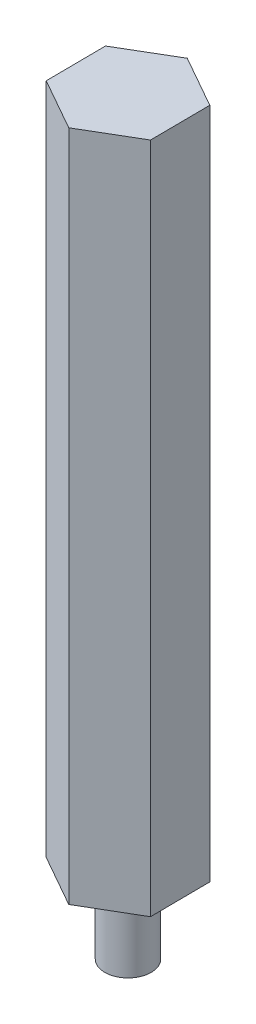
ISO-10303-21;
HEADER;
FILE_DESCRIPTION(('STEP AP214'),'2;1');
FILE_NAME('part.step','',(''),(''),'','','');
FILE_SCHEMA(('AUTOMOTIVE_DESIGN { 1 0 10303 214 1 1 1 1 }'));
ENDSEC;
DATA;
#1=APPLICATION_CONTEXT('core data for automotive mechanical design processes');
#2=APPLICATION_PROTOCOL_DEFINITION('international standard','automotive_design',2000,#1);
#3=PRODUCT_CONTEXT('',#1,'mechanical');
#4=PRODUCT('Part','Part','',(#3));
#5=PRODUCT_RELATED_PRODUCT_CATEGORY('part','',(#4));
#6=PRODUCT_DEFINITION_FORMATION('','',#4);
#7=PRODUCT_DEFINITION_CONTEXT('part definition',#1,'design');
#8=PRODUCT_DEFINITION('design','',#6,#7);
#9=PRODUCT_DEFINITION_SHAPE('','',#8);
#10=(LENGTH_UNIT() NAMED_UNIT(*) SI_UNIT(.MILLI.,.METRE.));
#11=(NAMED_UNIT(*) PLANE_ANGLE_UNIT() SI_UNIT($,.RADIAN.));
#12=(NAMED_UNIT(*) SI_UNIT($,.STERADIAN.) SOLID_ANGLE_UNIT());
#13=UNCERTAINTY_MEASURE_WITH_UNIT(LENGTH_MEASURE(1.E-05),#10,'distance_accuracy_value','');
#14=(GEOMETRIC_REPRESENTATION_CONTEXT(3) GLOBAL_UNCERTAINTY_ASSIGNED_CONTEXT((#13)) GLOBAL_UNIT_ASSIGNED_CONTEXT((#10,
#11,#12)) REPRESENTATION_CONTEXT('',''));
#15=CARTESIAN_POINT('',(0.,0.,0.));
#16=DIRECTION('',(0.,0.,1.));
#17=DIRECTION('',(1.,0.,0.));
#18=AXIS2_PLACEMENT_3D('',#15,#16,#17);
#19=CARTESIAN_POINT('',(0.0298632609561382,41.28,3.66605257995278));
#20=DIRECTION('',(-0.507037725556346,0.,-0.861923862567134));
#21=DIRECTION('',(-0.861923862567134,0.,0.507037725556346));
#22=AXIS2_PLACEMENT_3D('',#19,#20,#21);
#23=PLANE('',#22);
#24=DIRECTION('',(0.861923862567134,0.,-0.507037725556346));
#25=VECTOR('',#24,1.);
#26=CARTESIAN_POINT('',(0.0298632609561382,0.,3.66605257995278));
#27=LINE('',#26,#25);
#28=CARTESIAN_POINT('',(0.0298632609561382,0.,3.66605257995278));
#29=VERTEX_POINT('',#28);
#30=CARTESIAN_POINT('',(3.18982629632666,0.,1.80716394734853));
#31=VERTEX_POINT('',#30);
#32=EDGE_CURVE('E130',#29,#31,#27,.T.);
#33=ORIENTED_EDGE('',*,*,#32,.T.);
#34=DIRECTION('',(0.,-1.,0.));
#35=VECTOR('',#34,1.);
#36=CARTESIAN_POINT('',(3.18982629632666,41.28,1.80716394734853));
#37=LINE('',#36,#35);
#38=CARTESIAN_POINT('',(3.18982629632666,41.28,1.80716394734853));
#39=VERTEX_POINT('',#38);
#40=EDGE_CURVE('E42',#39,#31,#37,.T.);
#41=ORIENTED_EDGE('',*,*,#40,.F.);
#42=DIRECTION('',(0.861923862567134,0.,-0.507037725556346));
#43=VECTOR('',#42,1.);
#44=CARTESIAN_POINT('',(0.0298632609561382,41.28,3.66605257995278));
#45=LINE('',#44,#43);
#46=CARTESIAN_POINT('',(0.0298632609561382,41.28,3.66605257995278));
#47=VERTEX_POINT('',#46);
#48=EDGE_CURVE('E147',#47,#39,#45,.T.);
#49=ORIENTED_EDGE('',*,*,#48,.F.);
#50=DIRECTION('',(0.,-1.,0.));
#51=VECTOR('',#50,1.);
#52=CARTESIAN_POINT('',(0.0298632609561382,41.28,3.66605257995278));
#53=LINE('',#52,#51);
#54=EDGE_CURVE('E126',#47,#29,#53,.T.);
#55=ORIENTED_EDGE('',*,*,#54,.T.);
#56=EDGE_LOOP('',(#33,#41,#49,#55));
#57=FACE_BOUND('',#56,.T.);
#58=ADVANCED_FACE('F39',(#57),#23,.F.);
#59=CARTESIAN_POINT('',(3.18982629632666,41.28,1.80716394734853));
#60=DIRECTION('',(-0.999966823889318,0.,0.00814561972531042));
#61=DIRECTION('',(0.00814561972531042,0.,0.999966823889318));
#62=AXIS2_PLACEMENT_3D('',#59,#60,#61);
#63=PLANE('',#62);
#64=DIRECTION('',(-0.00814561972531042,0.,-0.999966823889318));
#65=VECTOR('',#64,1.);
#66=CARTESIAN_POINT('',(3.18982629632666,0.,1.80716394734853));
#67=LINE('',#66,#65);
#68=CARTESIAN_POINT('',(3.15996303537052,0.,-1.85888863260425));
#69=VERTEX_POINT('',#68);
#70=EDGE_CURVE('E134',#31,#69,#67,.T.);
#71=ORIENTED_EDGE('',*,*,#70,.T.);
#72=DIRECTION('',(0.,-1.,0.));
#73=VECTOR('',#72,1.);
#74=CARTESIAN_POINT('',(3.15996303537052,41.28,-1.85888863260425));
#75=LINE('',#74,#73);
#76=CARTESIAN_POINT('',(3.15996303537052,41.28,-1.85888863260425));
#77=VERTEX_POINT('',#76);
#78=EDGE_CURVE('E153',#77,#69,#75,.T.);
#79=ORIENTED_EDGE('',*,*,#78,.F.);
#80=DIRECTION('',(-0.00814561972531042,0.,-0.999966823889318));
#81=VECTOR('',#80,1.);
#82=CARTESIAN_POINT('',(3.18982629632666,41.28,1.80716394734853));
#83=LINE('',#82,#81);
#84=EDGE_CURVE('E95',#39,#77,#83,.T.);
#85=ORIENTED_EDGE('',*,*,#84,.F.);
#86=ORIENTED_EDGE('',*,*,#40,.T.);
#87=EDGE_LOOP('',(#71,#79,#85,#86));
#88=FACE_BOUND('',#87,.T.);
#89=ADVANCED_FACE('F160',(#88),#63,.F.);
#90=CARTESIAN_POINT('',(3.15996303537052,41.28,-1.85888863260425));
#91=DIRECTION('',(-0.492929098332973,0.,0.870069482292444));
#92=DIRECTION('',(0.870069482292444,0.,0.492929098332973));
#93=AXIS2_PLACEMENT_3D('',#90,#91,#92);
#94=PLANE('',#93);
#95=DIRECTION('',(-0.870069482292444,0.,-0.492929098332973));
#96=VECTOR('',#95,1.);
#97=CARTESIAN_POINT('',(3.15996303537052,0.,-1.85888863260425));
#98=LINE('',#97,#96);
#99=CARTESIAN_POINT('',(-0.0298632609561376,0.,-3.66605257995278));
#100=VERTEX_POINT('',#99);
#101=EDGE_CURVE('E138',#69,#100,#98,.T.);
#102=ORIENTED_EDGE('',*,*,#101,.T.);
#103=DIRECTION('',(0.,-1.,0.));
#104=VECTOR('',#103,1.);
#105=CARTESIAN_POINT('',(-0.0298632609561376,41.28,-3.66605257995278));
#106=LINE('',#105,#104);
#107=CARTESIAN_POINT('',(-0.0298632609561376,41.28,-3.66605257995278));
#108=VERTEX_POINT('',#107);
#109=EDGE_CURVE('E119',#108,#100,#106,.T.);
#110=ORIENTED_EDGE('',*,*,#109,.F.);
#111=DIRECTION('',(-0.870069482292444,0.,-0.492929098332973));
#112=VECTOR('',#111,1.);
#113=CARTESIAN_POINT('',(3.15996303537052,41.28,-1.85888863260425));
#114=LINE('',#113,#112);
#115=EDGE_CURVE('E108',#77,#108,#114,.T.);
#116=ORIENTED_EDGE('',*,*,#115,.F.);
#117=ORIENTED_EDGE('',*,*,#78,.T.);
#118=EDGE_LOOP('',(#102,#110,#116,#117));
#119=FACE_BOUND('',#118,.T.);
#120=ADVANCED_FACE('F166',(#119),#94,.F.);
#121=CARTESIAN_POINT('',(-0.0298632609561376,41.28,-3.66605257995278));
#122=DIRECTION('',(0.507037725556345,0.,0.861923862567134));
#123=DIRECTION('',(0.861923862567134,0.,-0.507037725556345));
#124=AXIS2_PLACEMENT_3D('',#121,#122,#123);
#125=PLANE('',#124);
#126=DIRECTION('',(-0.861923862567134,0.,0.507037725556345));
#127=VECTOR('',#126,1.);
#128=CARTESIAN_POINT('',(-0.0298632609561376,0.,-3.66605257995278));
#129=LINE('',#128,#127);
#130=CARTESIAN_POINT('',(-3.18982629632665,0.,-1.80716394734853));
#131=VERTEX_POINT('',#130);
#132=EDGE_CURVE('E117',#100,#131,#129,.T.);
#133=ORIENTED_EDGE('',*,*,#132,.T.);
#134=DIRECTION('',(0.,-1.,0.));
#135=VECTOR('',#134,1.);
#136=CARTESIAN_POINT('',(-3.18982629632665,41.28,-1.80716394734853));
#137=LINE('',#136,#135);
#138=CARTESIAN_POINT('',(-3.18982629632665,41.28,-1.80716394734853));
#139=VERTEX_POINT('',#138);
#140=EDGE_CURVE('E114',#139,#131,#137,.T.);
#141=ORIENTED_EDGE('',*,*,#140,.F.);
#142=DIRECTION('',(-0.861923862567134,0.,0.507037725556345));
#143=VECTOR('',#142,1.);
#144=CARTESIAN_POINT('',(-0.0298632609561376,41.28,-3.66605257995278));
#145=LINE('',#144,#143);
#146=EDGE_CURVE('E102',#108,#139,#145,.T.);
#147=ORIENTED_EDGE('',*,*,#146,.F.);
#148=ORIENTED_EDGE('',*,*,#109,.T.);
#149=EDGE_LOOP('',(#133,#141,#147,#148));
#150=FACE_BOUND('',#149,.T.);
#151=ADVANCED_FACE('F115',(#150),#125,.F.);
#152=CARTESIAN_POINT('',(-3.18982629632665,41.28,-1.80716394734853));
#153=DIRECTION('',(0.999966823889318,0.,-0.00814561972530994));
#154=DIRECTION('',(-0.00814561972530994,0.,-0.999966823889318));
#155=AXIS2_PLACEMENT_3D('',#152,#153,#154);
#156=PLANE('',#155);
#157=DIRECTION('',(0.00814561972530994,0.,0.999966823889318));
#158=VECTOR('',#157,1.);
#159=CARTESIAN_POINT('',(-3.18982629632665,0.,-1.80716394734853));
#160=LINE('',#159,#158);
#161=CARTESIAN_POINT('',(-3.15996303537052,0.,1.85888863260425));
#162=VERTEX_POINT('',#161);
#163=EDGE_CURVE('E80',#131,#162,#160,.T.);
#164=ORIENTED_EDGE('',*,*,#163,.T.);
#165=DIRECTION('',(0.,-1.,0.));
#166=VECTOR('',#165,1.);
#167=CARTESIAN_POINT('',(-3.15996303537052,41.28,1.85888863260425));
#168=LINE('',#167,#166);
#169=CARTESIAN_POINT('',(-3.15996303537052,41.28,1.85888863260425));
#170=VERTEX_POINT('',#169);
#171=EDGE_CURVE('E120',#170,#162,#168,.T.);
#172=ORIENTED_EDGE('',*,*,#171,.F.);
#173=DIRECTION('',(0.00814561972530994,0.,0.999966823889318));
#174=VECTOR('',#173,1.);
#175=CARTESIAN_POINT('',(-3.18982629632665,41.28,-1.80716394734853));
#176=LINE('',#175,#174);
#177=EDGE_CURVE('E106',#139,#170,#176,.T.);
#178=ORIENTED_EDGE('',*,*,#177,.F.);
#179=ORIENTED_EDGE('',*,*,#140,.T.);
#180=EDGE_LOOP('',(#164,#172,#178,#179));
#181=FACE_BOUND('',#180,.T.);
#182=ADVANCED_FACE('F122',(#181),#156,.F.);
#183=CARTESIAN_POINT('',(-3.15996303537052,41.28,1.85888863260425));
#184=DIRECTION('',(0.492929098332973,0.,-0.870069482292444));
#185=DIRECTION('',(-0.870069482292444,0.,-0.492929098332973));
#186=AXIS2_PLACEMENT_3D('',#183,#184,#185);
#187=PLANE('',#186);
#188=DIRECTION('',(0.870069482292444,0.,0.492929098332973));
#189=VECTOR('',#188,1.);
#190=CARTESIAN_POINT('',(-3.15996303537052,0.,1.85888863260425));
#191=LINE('',#190,#189);
#192=EDGE_CURVE('E86',#162,#29,#191,.T.);
#193=ORIENTED_EDGE('',*,*,#192,.T.);
#194=ORIENTED_EDGE('',*,*,#54,.F.);
#195=DIRECTION('',(0.870069482292444,0.,0.492929098332973));
#196=VECTOR('',#195,1.);
#197=CARTESIAN_POINT('',(-3.15996303537052,41.28,1.85888863260425));
#198=LINE('',#197,#196);
#199=EDGE_CURVE('E57',#170,#47,#198,.T.);
#200=ORIENTED_EDGE('',*,*,#199,.F.);
#201=ORIENTED_EDGE('',*,*,#171,.T.);
#202=EDGE_LOOP('',(#193,#194,#200,#201));
#203=FACE_BOUND('',#202,.T.);
#204=ADVANCED_FACE('F190',(#203),#187,.F.);
#205=CARTESIAN_POINT('',(0.,41.28,0.));
#206=DIRECTION('',(0.,1.,0.));
#207=DIRECTION('',(0.,0.,1.));
#208=AXIS2_PLACEMENT_3D('',#205,#206,#207);
#209=PLANE('',#208);
#210=ORIENTED_EDGE('',*,*,#48,.T.);
#211=ORIENTED_EDGE('',*,*,#84,.T.);
#212=ORIENTED_EDGE('',*,*,#115,.T.);
#213=ORIENTED_EDGE('',*,*,#146,.T.);
#214=ORIENTED_EDGE('',*,*,#177,.T.);
#215=ORIENTED_EDGE('',*,*,#199,.T.);
#216=EDGE_LOOP('',(#210,#211,#212,#213,#214,#215));
#217=FACE_BOUND('',#216,.T.);
#218=ADVANCED_FACE('F104',(#217),#209,.T.);
#219=CARTESIAN_POINT('',(0.,0.,0.));
#220=DIRECTION('',(0.,1.,0.));
#221=DIRECTION('',(0.,0.,1.));
#222=AXIS2_PLACEMENT_3D('',#219,#220,#221);
#223=PLANE('',#222);
#224=CARTESIAN_POINT('',(0.,0.,0.));
#225=DIRECTION('',(0.,-1.,0.));
#226=DIRECTION('',(0.,0.,-1.));
#227=AXIS2_PLACEMENT_3D('',#224,#225,#226);
#228=CIRCLE('',#227,1.4224);
#229=CARTESIAN_POINT('',(0.,0.,-1.4224));
#230=VERTEX_POINT('',#229);
#231=EDGE_CURVE('E11',#230,#230,#228,.T.);
#232=ORIENTED_EDGE('',*,*,#231,.F.);
#233=EDGE_LOOP('',(#232));
#234=FACE_BOUND('',#233,.T.);
#235=ORIENTED_EDGE('',*,*,#32,.F.);
#236=ORIENTED_EDGE('',*,*,#192,.F.);
#237=ORIENTED_EDGE('',*,*,#163,.F.);
#238=ORIENTED_EDGE('',*,*,#132,.F.);
#239=ORIENTED_EDGE('',*,*,#101,.F.);
#240=ORIENTED_EDGE('',*,*,#70,.F.);
#241=EDGE_LOOP('',(#235,#236,#237,#238,#239,#240));
#242=FACE_BOUND('',#241,.T.);
#243=ADVANCED_FACE('F165',(#234,#242),#223,.F.);
#244=CARTESIAN_POINT('',(0.,-4.75,0.));
#245=DIRECTION('',(0.,1.,0.));
#246=DIRECTION('',(0.,0.,1.));
#247=AXIS2_PLACEMENT_3D('',#244,#245,#246);
#248=CYLINDRICAL_SURFACE('',#247,1.4224);
#249=CARTESIAN_POINT('',(0.,-4.75,0.));
#250=DIRECTION('',(0.,-1.,0.));
#251=DIRECTION('',(0.,0.,-1.));
#252=AXIS2_PLACEMENT_3D('',#249,#250,#251);
#253=CIRCLE('',#252,1.4224);
#254=CARTESIAN_POINT('',(0.,-4.75,-1.4224));
#255=VERTEX_POINT('',#254);
#256=EDGE_CURVE('E135',#255,#255,#253,.T.);
#257=ORIENTED_EDGE('',*,*,#256,.F.);
#258=EDGE_LOOP('',(#257));
#259=FACE_BOUND('',#258,.T.);
#260=ORIENTED_EDGE('',*,*,#231,.T.);
#261=EDGE_LOOP('',(#260));
#262=FACE_BOUND('',#261,.T.);
#263=ADVANCED_FACE('F179',(#259,#262),#248,.T.);
#264=CARTESIAN_POINT('',(0.,-4.75,0.));
#265=DIRECTION('',(0.,-1.,0.));
#266=DIRECTION('',(0.,0.,-1.));
#267=AXIS2_PLACEMENT_3D('',#264,#265,#266);
#268=PLANE('',#267);
#269=ORIENTED_EDGE('',*,*,#256,.T.);
#270=EDGE_LOOP('',(#269));
#271=FACE_BOUND('',#270,.T.);
#272=ADVANCED_FACE('F177',(#271),#268,.T.);
#273=CLOSED_SHELL('',(#58,#89,#120,#151,#182,#204,#218,#243,#263,#272));
#274=MANIFOLD_SOLID_BREP('B2',#273);
#275=ADVANCED_BREP_SHAPE_REPRESENTATION('',(#18,#274),#14);
#276=SHAPE_DEFINITION_REPRESENTATION(#9,#275);
ENDSEC;
END-ISO-10303-21;
